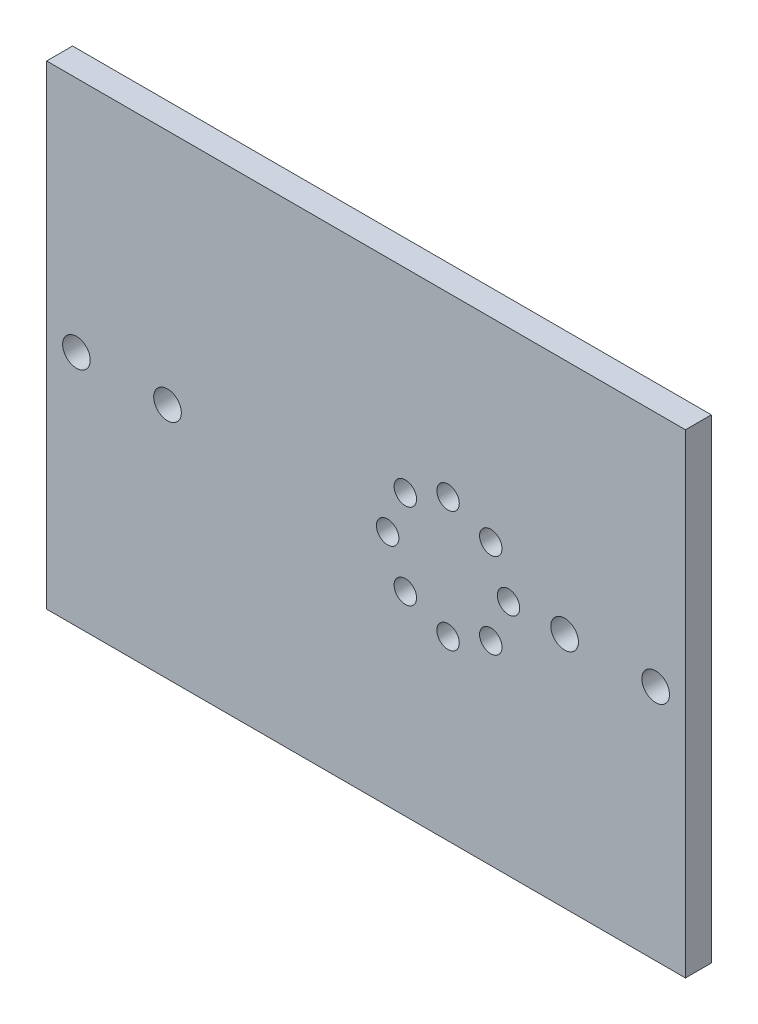
ISO-10303-21;
HEADER;
FILE_DESCRIPTION(('STEP AP214'),'2;1');
FILE_NAME('part.step','',(''),(''),'','','');
FILE_SCHEMA(('AUTOMOTIVE_DESIGN { 1 0 10303 214 1 1 1 1 }'));
ENDSEC;
DATA;
#1=APPLICATION_CONTEXT('core data for automotive mechanical design processes');
#2=APPLICATION_PROTOCOL_DEFINITION('international standard','automotive_design',2000,#1);
#3=PRODUCT_CONTEXT('',#1,'mechanical');
#4=PRODUCT('Part','Part','',(#3));
#5=PRODUCT_RELATED_PRODUCT_CATEGORY('part','',(#4));
#6=PRODUCT_DEFINITION_FORMATION('','',#4);
#7=PRODUCT_DEFINITION_CONTEXT('part definition',#1,'design');
#8=PRODUCT_DEFINITION('design','',#6,#7);
#9=PRODUCT_DEFINITION_SHAPE('','',#8);
#10=(LENGTH_UNIT() NAMED_UNIT(*) SI_UNIT(.MILLI.,.METRE.));
#11=(NAMED_UNIT(*) PLANE_ANGLE_UNIT() SI_UNIT($,.RADIAN.));
#12=(NAMED_UNIT(*) SI_UNIT($,.STERADIAN.) SOLID_ANGLE_UNIT());
#13=UNCERTAINTY_MEASURE_WITH_UNIT(LENGTH_MEASURE(1.E-05),#10,'distance_accuracy_value','');
#14=(GEOMETRIC_REPRESENTATION_CONTEXT(3) GLOBAL_UNCERTAINTY_ASSIGNED_CONTEXT((#13)) GLOBAL_UNIT_ASSIGNED_CONTEXT((#10,
#11,#12)) REPRESENTATION_CONTEXT('',''));
#15=CARTESIAN_POINT('',(0.,0.,0.));
#16=DIRECTION('',(0.,0.,1.));
#17=DIRECTION('',(1.,0.,0.));
#18=AXIS2_PLACEMENT_3D('',#15,#16,#17);
#19=CARTESIAN_POINT('',(37.,27.5,3.));
#20=DIRECTION('',(-1.,0.,0.));
#21=DIRECTION('',(0.,-1.,0.));
#22=AXIS2_PLACEMENT_3D('',#19,#20,#21);
#23=PLANE('',#22);
#24=DIRECTION('',(0.,1.,0.));
#25=VECTOR('',#24,1.);
#26=CARTESIAN_POINT('',(37.,27.5,0.));
#27=LINE('',#26,#25);
#28=CARTESIAN_POINT('',(37.,-27.5,0.));
#29=VERTEX_POINT('',#28);
#30=CARTESIAN_POINT('',(37.,27.5,0.));
#31=VERTEX_POINT('',#30);
#32=EDGE_CURVE('E107',#29,#31,#27,.T.);
#33=ORIENTED_EDGE('',*,*,#32,.T.);
#34=DIRECTION('',(0.,0.,-1.));
#35=VECTOR('',#34,1.);
#36=CARTESIAN_POINT('',(37.,27.5,3.));
#37=LINE('',#36,#35);
#38=CARTESIAN_POINT('',(37.,27.5,3.));
#39=VERTEX_POINT('',#38);
#40=EDGE_CURVE('E11',#39,#31,#37,.T.);
#41=ORIENTED_EDGE('',*,*,#40,.F.);
#42=DIRECTION('',(0.,1.,0.));
#43=VECTOR('',#42,1.);
#44=CARTESIAN_POINT('',(37.,27.5,3.));
#45=LINE('',#44,#43);
#46=CARTESIAN_POINT('',(37.,-27.5,3.));
#47=VERTEX_POINT('',#46);
#48=EDGE_CURVE('E91',#47,#39,#45,.T.);
#49=ORIENTED_EDGE('',*,*,#48,.F.);
#50=DIRECTION('',(0.,0.,-1.));
#51=VECTOR('',#50,1.);
#52=CARTESIAN_POINT('',(37.,-27.5,3.));
#53=LINE('',#52,#51);
#54=EDGE_CURVE('E103',#47,#29,#53,.T.);
#55=ORIENTED_EDGE('',*,*,#54,.T.);
#56=EDGE_LOOP('',(#33,#41,#49,#55));
#57=FACE_BOUND('',#56,.T.);
#58=ADVANCED_FACE('F39',(#57),#23,.F.);
#59=CARTESIAN_POINT('',(-37.,27.5,3.));
#60=DIRECTION('',(0.,-1.,0.));
#61=DIRECTION('',(0.,0.,-1.));
#62=AXIS2_PLACEMENT_3D('',#59,#60,#61);
#63=PLANE('',#62);
#64=DIRECTION('',(-1.,0.,0.));
#65=VECTOR('',#64,1.);
#66=CARTESIAN_POINT('',(-37.,27.5,0.));
#67=LINE('',#66,#65);
#68=CARTESIAN_POINT('',(-37.,27.5,0.));
#69=VERTEX_POINT('',#68);
#70=EDGE_CURVE('E96',#31,#69,#67,.T.);
#71=ORIENTED_EDGE('',*,*,#70,.T.);
#72=DIRECTION('',(0.,0.,-1.));
#73=VECTOR('',#72,1.);
#74=CARTESIAN_POINT('',(-37.,27.5,3.));
#75=LINE('',#74,#73);
#76=CARTESIAN_POINT('',(-37.,27.5,3.));
#77=VERTEX_POINT('',#76);
#78=EDGE_CURVE('E48',#77,#69,#75,.T.);
#79=ORIENTED_EDGE('',*,*,#78,.F.);
#80=DIRECTION('',(-1.,0.,0.));
#81=VECTOR('',#80,1.);
#82=CARTESIAN_POINT('',(-37.,27.5,3.));
#83=LINE('',#82,#81);
#84=EDGE_CURVE('E86',#39,#77,#83,.T.);
#85=ORIENTED_EDGE('',*,*,#84,.F.);
#86=ORIENTED_EDGE('',*,*,#40,.T.);
#87=EDGE_LOOP('',(#71,#79,#85,#86));
#88=FACE_BOUND('',#87,.T.);
#89=ADVANCED_FACE('F95',(#88),#63,.F.);
#90=CARTESIAN_POINT('',(-37.,27.5,3.));
#91=DIRECTION('',(1.,0.,0.));
#92=DIRECTION('',(0.,1.,0.));
#93=AXIS2_PLACEMENT_3D('',#90,#91,#92);
#94=PLANE('',#93);
#95=DIRECTION('',(0.,-1.,0.));
#96=VECTOR('',#95,1.);
#97=CARTESIAN_POINT('',(-37.,27.5,0.));
#98=LINE('',#97,#96);
#99=CARTESIAN_POINT('',(-37.,-27.5,0.));
#100=VERTEX_POINT('',#99);
#101=EDGE_CURVE('E73',#69,#100,#98,.T.);
#102=ORIENTED_EDGE('',*,*,#101,.T.);
#103=DIRECTION('',(0.,0.,-1.));
#104=VECTOR('',#103,1.);
#105=CARTESIAN_POINT('',(-37.,-27.5,3.));
#106=LINE('',#105,#104);
#107=CARTESIAN_POINT('',(-37.,-27.5,3.));
#108=VERTEX_POINT('',#107);
#109=EDGE_CURVE('E98',#108,#100,#106,.T.);
#110=ORIENTED_EDGE('',*,*,#109,.F.);
#111=DIRECTION('',(0.,-1.,0.));
#112=VECTOR('',#111,1.);
#113=CARTESIAN_POINT('',(-37.,27.5,3.));
#114=LINE('',#113,#112);
#115=EDGE_CURVE('E89',#77,#108,#114,.T.);
#116=ORIENTED_EDGE('',*,*,#115,.F.);
#117=ORIENTED_EDGE('',*,*,#78,.T.);
#118=EDGE_LOOP('',(#102,#110,#116,#117));
#119=FACE_BOUND('',#118,.T.);
#120=ADVANCED_FACE('F99',(#119),#94,.F.);
#121=CARTESIAN_POINT('',(-37.,-27.5,3.));
#122=DIRECTION('',(0.,1.,0.));
#123=DIRECTION('',(0.,0.,1.));
#124=AXIS2_PLACEMENT_3D('',#121,#122,#123);
#125=PLANE('',#124);
#126=DIRECTION('',(1.,0.,0.));
#127=VECTOR('',#126,1.);
#128=CARTESIAN_POINT('',(-37.,-27.5,0.));
#129=LINE('',#128,#127);
#130=EDGE_CURVE('E79',#100,#29,#129,.T.);
#131=ORIENTED_EDGE('',*,*,#130,.T.);
#132=ORIENTED_EDGE('',*,*,#54,.F.);
#133=DIRECTION('',(1.,0.,0.));
#134=VECTOR('',#133,1.);
#135=CARTESIAN_POINT('',(-37.,-27.5,3.));
#136=LINE('',#135,#134);
#137=EDGE_CURVE('E56',#108,#47,#136,.T.);
#138=ORIENTED_EDGE('',*,*,#137,.F.);
#139=ORIENTED_EDGE('',*,*,#109,.T.);
#140=EDGE_LOOP('',(#131,#132,#138,#139));
#141=FACE_BOUND('',#140,.T.);
#142=ADVANCED_FACE('F121',(#141),#125,.F.);
#143=CARTESIAN_POINT('',(0.,0.,3.));
#144=DIRECTION('',(0.,0.,1.));
#145=DIRECTION('',(1.,0.,0.));
#146=AXIS2_PLACEMENT_3D('',#143,#144,#145);
#147=PLANE('',#146);
#148=CARTESIAN_POINT('',(14.4497474683058,4.94974746830585,3.));
#149=DIRECTION('',(0.,0.,1.));
#150=DIRECTION('',(1.,0.,0.));
#151=AXIS2_PLACEMENT_3D('',#148,#149,#150);
#152=CIRCLE('',#151,1.3);
#153=CARTESIAN_POINT('',(15.7497474683058,4.94974746830585,3.));
#154=VERTEX_POINT('',#153);
#155=EDGE_CURVE('E168',#154,#154,#152,.T.);
#156=ORIENTED_EDGE('',*,*,#155,.F.);
#157=EDGE_LOOP('',(#156));
#158=FACE_BOUND('',#157,.T.);
#159=CARTESIAN_POINT('',(16.5,0.,3.));
#160=DIRECTION('',(0.,0.,1.));
#161=DIRECTION('',(1.,0.,0.));
#162=AXIS2_PLACEMENT_3D('',#159,#160,#161);
#163=CIRCLE('',#162,1.3);
#164=CARTESIAN_POINT('',(17.8,0.,3.));
#165=VERTEX_POINT('',#164);
#166=EDGE_CURVE('E176',#165,#165,#163,.T.);
#167=ORIENTED_EDGE('',*,*,#166,.F.);
#168=EDGE_LOOP('',(#167));
#169=FACE_BOUND('',#168,.T.);
#170=CARTESIAN_POINT('',(14.4497474683058,-4.94974746830582,3.));
#171=DIRECTION('',(0.,0.,1.));
#172=DIRECTION('',(1.,0.,0.));
#173=AXIS2_PLACEMENT_3D('',#170,#171,#172);
#174=CIRCLE('',#173,1.3);
#175=CARTESIAN_POINT('',(15.7497474683058,-4.94974746830582,3.));
#176=VERTEX_POINT('',#175);
#177=EDGE_CURVE('E184',#176,#176,#174,.T.);
#178=ORIENTED_EDGE('',*,*,#177,.F.);
#179=EDGE_LOOP('',(#178));
#180=FACE_BOUND('',#179,.T.);
#181=CARTESIAN_POINT('',(9.5,-6.99999999999999,3.));
#182=DIRECTION('',(0.,0.,1.));
#183=DIRECTION('',(1.,0.,0.));
#184=AXIS2_PLACEMENT_3D('',#181,#182,#183);
#185=CIRCLE('',#184,1.3);
#186=CARTESIAN_POINT('',(10.8,-6.99999999999999,3.));
#187=VERTEX_POINT('',#186);
#188=EDGE_CURVE('E192',#187,#187,#185,.T.);
#189=ORIENTED_EDGE('',*,*,#188,.F.);
#190=EDGE_LOOP('',(#189));
#191=FACE_BOUND('',#190,.T.);
#192=CARTESIAN_POINT('',(4.55025253169416,-4.94974746830582,3.));
#193=DIRECTION('',(0.,0.,1.));
#194=DIRECTION('',(1.,0.,0.));
#195=AXIS2_PLACEMENT_3D('',#192,#193,#194);
#196=CIRCLE('',#195,1.3);
#197=CARTESIAN_POINT('',(5.85025253169416,-4.94974746830582,3.));
#198=VERTEX_POINT('',#197);
#199=EDGE_CURVE('E200',#198,#198,#196,.T.);
#200=ORIENTED_EDGE('',*,*,#199,.F.);
#201=EDGE_LOOP('',(#200));
#202=FACE_BOUND('',#201,.T.);
#203=CARTESIAN_POINT('',(2.5,0.,3.));
#204=DIRECTION('',(0.,0.,1.));
#205=DIRECTION('',(1.,0.,0.));
#206=AXIS2_PLACEMENT_3D('',#203,#204,#205);
#207=CIRCLE('',#206,1.3);
#208=CARTESIAN_POINT('',(3.8,0.,3.));
#209=VERTEX_POINT('',#208);
#210=EDGE_CURVE('E208',#209,#209,#207,.T.);
#211=ORIENTED_EDGE('',*,*,#210,.F.);
#212=EDGE_LOOP('',(#211));
#213=FACE_BOUND('',#212,.T.);
#214=CARTESIAN_POINT('',(4.55025253169417,4.94974746830585,3.));
#215=DIRECTION('',(0.,0.,1.));
#216=DIRECTION('',(1.,0.,0.));
#217=AXIS2_PLACEMENT_3D('',#214,#215,#216);
#218=CIRCLE('',#217,1.3);
#219=CARTESIAN_POINT('',(5.85025253169417,4.94974746830585,3.));
#220=VERTEX_POINT('',#219);
#221=EDGE_CURVE('E216',#220,#220,#218,.T.);
#222=ORIENTED_EDGE('',*,*,#221,.F.);
#223=EDGE_LOOP('',(#222));
#224=FACE_BOUND('',#223,.T.);
#225=CARTESIAN_POINT('',(9.5,7.00000000000002,3.));
#226=DIRECTION('',(0.,0.,1.));
#227=DIRECTION('',(1.,0.,0.));
#228=AXIS2_PLACEMENT_3D('',#225,#226,#227);
#229=CIRCLE('',#228,1.3);
#230=CARTESIAN_POINT('',(10.8,7.00000000000002,3.));
#231=VERTEX_POINT('',#230);
#232=EDGE_CURVE('E160',#231,#231,#229,.T.);
#233=ORIENTED_EDGE('',*,*,#232,.F.);
#234=EDGE_LOOP('',(#233));
#235=FACE_BOUND('',#234,.T.);
#236=CARTESIAN_POINT('',(-33.55,0.,3.));
#237=DIRECTION('',(0.,0.,1.));
#238=DIRECTION('',(1.,0.,0.));
#239=AXIS2_PLACEMENT_3D('',#236,#237,#238);
#240=CIRCLE('',#239,1.60000000000001);
#241=CARTESIAN_POINT('',(-31.95,0.,3.));
#242=VERTEX_POINT('',#241);
#243=EDGE_CURVE('E153',#242,#242,#240,.T.);
#244=ORIENTED_EDGE('',*,*,#243,.F.);
#245=EDGE_LOOP('',(#244));
#246=FACE_BOUND('',#245,.T.);
#247=CARTESIAN_POINT('',(-23.,0.,3.));
#248=DIRECTION('',(0.,0.,1.));
#249=DIRECTION('',(1.,0.,0.));
#250=AXIS2_PLACEMENT_3D('',#247,#248,#249);
#251=CIRCLE('',#250,1.6);
#252=CARTESIAN_POINT('',(-21.4,0.,3.));
#253=VERTEX_POINT('',#252);
#254=EDGE_CURVE('E149',#253,#253,#251,.T.);
#255=ORIENTED_EDGE('',*,*,#254,.F.);
#256=EDGE_LOOP('',(#255));
#257=FACE_BOUND('',#256,.T.);
#258=CARTESIAN_POINT('',(23.,0.,3.));
#259=DIRECTION('',(0.,0.,1.));
#260=DIRECTION('',(1.,0.,0.));
#261=AXIS2_PLACEMENT_3D('',#258,#259,#260);
#262=CIRCLE('',#261,1.6);
#263=CARTESIAN_POINT('',(24.6,0.,3.));
#264=VERTEX_POINT('',#263);
#265=EDGE_CURVE('E141',#264,#264,#262,.T.);
#266=ORIENTED_EDGE('',*,*,#265,.F.);
#267=EDGE_LOOP('',(#266));
#268=FACE_BOUND('',#267,.T.);
#269=CARTESIAN_POINT('',(33.55,0.,3.));
#270=DIRECTION('',(0.,0.,1.));
#271=DIRECTION('',(1.,0.,0.));
#272=AXIS2_PLACEMENT_3D('',#269,#270,#271);
#273=CIRCLE('',#272,1.6);
#274=CARTESIAN_POINT('',(35.15,0.,3.));
#275=VERTEX_POINT('',#274);
#276=EDGE_CURVE('E132',#275,#275,#273,.T.);
#277=ORIENTED_EDGE('',*,*,#276,.F.);
#278=EDGE_LOOP('',(#277));
#279=FACE_BOUND('',#278,.T.);
#280=ORIENTED_EDGE('',*,*,#48,.T.);
#281=ORIENTED_EDGE('',*,*,#84,.T.);
#282=ORIENTED_EDGE('',*,*,#115,.T.);
#283=ORIENTED_EDGE('',*,*,#137,.T.);
#284=EDGE_LOOP('',(#280,#281,#282,#283));
#285=FACE_BOUND('',#284,.T.);
#286=ADVANCED_FACE('F87',(#158,#169,#180,#191,#202,#213,#224,#235,#246,#257,#268,#279,#285),
#147,.T.);
#287=CARTESIAN_POINT('',(0.,0.,0.));
#288=DIRECTION('',(0.,0.,1.));
#289=DIRECTION('',(1.,0.,0.));
#290=AXIS2_PLACEMENT_3D('',#287,#288,#289);
#291=PLANE('',#290);
#292=CARTESIAN_POINT('',(14.4497474683058,4.94974746830585,0.));
#293=DIRECTION('',(0.,0.,1.));
#294=DIRECTION('',(1.,0.,0.));
#295=AXIS2_PLACEMENT_3D('',#292,#293,#294);
#296=CIRCLE('',#295,1.3);
#297=CARTESIAN_POINT('',(15.7497474683058,4.94974746830585,0.));
#298=VERTEX_POINT('',#297);
#299=EDGE_CURVE('E172',#298,#298,#296,.T.);
#300=ORIENTED_EDGE('',*,*,#299,.T.);
#301=EDGE_LOOP('',(#300));
#302=FACE_BOUND('',#301,.T.);
#303=CARTESIAN_POINT('',(16.5,0.,0.));
#304=DIRECTION('',(0.,0.,1.));
#305=DIRECTION('',(1.,0.,0.));
#306=AXIS2_PLACEMENT_3D('',#303,#304,#305);
#307=CIRCLE('',#306,1.3);
#308=CARTESIAN_POINT('',(17.8,0.,0.));
#309=VERTEX_POINT('',#308);
#310=EDGE_CURVE('E180',#309,#309,#307,.T.);
#311=ORIENTED_EDGE('',*,*,#310,.T.);
#312=EDGE_LOOP('',(#311));
#313=FACE_BOUND('',#312,.T.);
#314=CARTESIAN_POINT('',(14.4497474683058,-4.94974746830582,0.));
#315=DIRECTION('',(0.,0.,1.));
#316=DIRECTION('',(1.,0.,0.));
#317=AXIS2_PLACEMENT_3D('',#314,#315,#316);
#318=CIRCLE('',#317,1.3);
#319=CARTESIAN_POINT('',(15.7497474683058,-4.94974746830582,0.));
#320=VERTEX_POINT('',#319);
#321=EDGE_CURVE('E188',#320,#320,#318,.T.);
#322=ORIENTED_EDGE('',*,*,#321,.T.);
#323=EDGE_LOOP('',(#322));
#324=FACE_BOUND('',#323,.T.);
#325=CARTESIAN_POINT('',(9.5,-6.99999999999999,0.));
#326=DIRECTION('',(0.,0.,1.));
#327=DIRECTION('',(1.,0.,0.));
#328=AXIS2_PLACEMENT_3D('',#325,#326,#327);
#329=CIRCLE('',#328,1.3);
#330=CARTESIAN_POINT('',(10.8,-6.99999999999999,0.));
#331=VERTEX_POINT('',#330);
#332=EDGE_CURVE('E196',#331,#331,#329,.T.);
#333=ORIENTED_EDGE('',*,*,#332,.T.);
#334=EDGE_LOOP('',(#333));
#335=FACE_BOUND('',#334,.T.);
#336=CARTESIAN_POINT('',(4.55025253169416,-4.94974746830582,0.));
#337=DIRECTION('',(0.,0.,1.));
#338=DIRECTION('',(1.,0.,0.));
#339=AXIS2_PLACEMENT_3D('',#336,#337,#338);
#340=CIRCLE('',#339,1.3);
#341=CARTESIAN_POINT('',(5.85025253169416,-4.94974746830582,0.));
#342=VERTEX_POINT('',#341);
#343=EDGE_CURVE('E204',#342,#342,#340,.T.);
#344=ORIENTED_EDGE('',*,*,#343,.T.);
#345=EDGE_LOOP('',(#344));
#346=FACE_BOUND('',#345,.T.);
#347=CARTESIAN_POINT('',(2.5,0.,0.));
#348=DIRECTION('',(0.,0.,1.));
#349=DIRECTION('',(1.,0.,0.));
#350=AXIS2_PLACEMENT_3D('',#347,#348,#349);
#351=CIRCLE('',#350,1.3);
#352=CARTESIAN_POINT('',(3.8,0.,0.));
#353=VERTEX_POINT('',#352);
#354=EDGE_CURVE('E212',#353,#353,#351,.T.);
#355=ORIENTED_EDGE('',*,*,#354,.T.);
#356=EDGE_LOOP('',(#355));
#357=FACE_BOUND('',#356,.T.);
#358=CARTESIAN_POINT('',(4.55025253169417,4.94974746830585,0.));
#359=DIRECTION('',(0.,0.,1.));
#360=DIRECTION('',(1.,0.,0.));
#361=AXIS2_PLACEMENT_3D('',#358,#359,#360);
#362=CIRCLE('',#361,1.3);
#363=CARTESIAN_POINT('',(5.85025253169417,4.94974746830585,0.));
#364=VERTEX_POINT('',#363);
#365=EDGE_CURVE('E164',#364,#364,#362,.T.);
#366=ORIENTED_EDGE('',*,*,#365,.T.);
#367=EDGE_LOOP('',(#366));
#368=FACE_BOUND('',#367,.T.);
#369=CARTESIAN_POINT('',(9.5,7.00000000000002,0.));
#370=DIRECTION('',(0.,0.,1.));
#371=DIRECTION('',(1.,0.,0.));
#372=AXIS2_PLACEMENT_3D('',#369,#370,#371);
#373=CIRCLE('',#372,1.3);
#374=CARTESIAN_POINT('',(10.8,7.00000000000002,0.));
#375=VERTEX_POINT('',#374);
#376=EDGE_CURVE('E133',#375,#375,#373,.T.);
#377=ORIENTED_EDGE('',*,*,#376,.T.);
#378=EDGE_LOOP('',(#377));
#379=FACE_BOUND('',#378,.T.);
#380=CARTESIAN_POINT('',(-33.55,0.,0.));
#381=DIRECTION('',(0.,0.,1.));
#382=DIRECTION('',(1.,0.,0.));
#383=AXIS2_PLACEMENT_3D('',#380,#381,#382);
#384=CIRCLE('',#383,1.60000000000001);
#385=CARTESIAN_POINT('',(-31.95,0.,0.));
#386=VERTEX_POINT('',#385);
#387=EDGE_CURVE('E111',#386,#386,#384,.T.);
#388=ORIENTED_EDGE('',*,*,#387,.T.);
#389=EDGE_LOOP('',(#388));
#390=FACE_BOUND('',#389,.T.);
#391=CARTESIAN_POINT('',(-23.,0.,0.));
#392=DIRECTION('',(0.,0.,1.));
#393=DIRECTION('',(1.,0.,0.));
#394=AXIS2_PLACEMENT_3D('',#391,#392,#393);
#395=CIRCLE('',#394,1.6);
#396=CARTESIAN_POINT('',(-21.4,0.,0.));
#397=VERTEX_POINT('',#396);
#398=EDGE_CURVE('E145',#397,#397,#395,.T.);
#399=ORIENTED_EDGE('',*,*,#398,.T.);
#400=EDGE_LOOP('',(#399));
#401=FACE_BOUND('',#400,.T.);
#402=CARTESIAN_POINT('',(23.,0.,0.));
#403=DIRECTION('',(0.,0.,1.));
#404=DIRECTION('',(1.,0.,0.));
#405=AXIS2_PLACEMENT_3D('',#402,#403,#404);
#406=CIRCLE('',#405,1.6);
#407=CARTESIAN_POINT('',(24.6,0.,0.));
#408=VERTEX_POINT('',#407);
#409=EDGE_CURVE('E137',#408,#408,#406,.T.);
#410=ORIENTED_EDGE('',*,*,#409,.T.);
#411=EDGE_LOOP('',(#410));
#412=FACE_BOUND('',#411,.T.);
#413=CARTESIAN_POINT('',(33.55,0.,0.));
#414=DIRECTION('',(0.,0.,1.));
#415=DIRECTION('',(1.,0.,0.));
#416=AXIS2_PLACEMENT_3D('',#413,#414,#415);
#417=CIRCLE('',#416,1.6);
#418=CARTESIAN_POINT('',(35.15,0.,0.));
#419=VERTEX_POINT('',#418);
#420=EDGE_CURVE('E128',#419,#419,#417,.T.);
#421=ORIENTED_EDGE('',*,*,#420,.T.);
#422=EDGE_LOOP('',(#421));
#423=FACE_BOUND('',#422,.T.);
#424=ORIENTED_EDGE('',*,*,#32,.F.);
#425=ORIENTED_EDGE('',*,*,#130,.F.);
#426=ORIENTED_EDGE('',*,*,#101,.F.);
#427=ORIENTED_EDGE('',*,*,#70,.F.);
#428=EDGE_LOOP('',(#424,#425,#426,#427));
#429=FACE_BOUND('',#428,.T.);
#430=ADVANCED_FACE('F124',(#302,#313,#324,#335,#346,#357,#368,#379,#390,#401,#412,#423,#429),
#291,.F.);
#431=CARTESIAN_POINT('',(33.55,0.,0.));
#432=DIRECTION('',(0.,0.,1.));
#433=DIRECTION('',(1.,0.,0.));
#434=AXIS2_PLACEMENT_3D('',#431,#432,#433);
#435=CYLINDRICAL_SURFACE('',#434,1.6);
#436=ORIENTED_EDGE('',*,*,#420,.F.);
#437=EDGE_LOOP('',(#436));
#438=FACE_BOUND('',#437,.T.);
#439=ORIENTED_EDGE('',*,*,#276,.T.);
#440=EDGE_LOOP('',(#439));
#441=FACE_BOUND('',#440,.T.);
#442=ADVANCED_FACE('F248',(#438,#441),#435,.F.);
#443=CARTESIAN_POINT('',(23.,0.,0.));
#444=DIRECTION('',(0.,0.,1.));
#445=DIRECTION('',(1.,0.,0.));
#446=AXIS2_PLACEMENT_3D('',#443,#444,#445);
#447=CYLINDRICAL_SURFACE('',#446,1.6);
#448=ORIENTED_EDGE('',*,*,#409,.F.);
#449=EDGE_LOOP('',(#448));
#450=FACE_BOUND('',#449,.T.);
#451=ORIENTED_EDGE('',*,*,#265,.T.);
#452=EDGE_LOOP('',(#451));
#453=FACE_BOUND('',#452,.T.);
#454=ADVANCED_FACE('F250',(#450,#453),#447,.F.);
#455=CARTESIAN_POINT('',(-23.,0.,0.));
#456=DIRECTION('',(0.,0.,1.));
#457=DIRECTION('',(1.,0.,0.));
#458=AXIS2_PLACEMENT_3D('',#455,#456,#457);
#459=CYLINDRICAL_SURFACE('',#458,1.6);
#460=ORIENTED_EDGE('',*,*,#398,.F.);
#461=EDGE_LOOP('',(#460));
#462=FACE_BOUND('',#461,.T.);
#463=ORIENTED_EDGE('',*,*,#254,.T.);
#464=EDGE_LOOP('',(#463));
#465=FACE_BOUND('',#464,.T.);
#466=ADVANCED_FACE('F257',(#462,#465),#459,.F.);
#467=CARTESIAN_POINT('',(-33.55,0.,0.));
#468=DIRECTION('',(0.,0.,1.));
#469=DIRECTION('',(1.,0.,0.));
#470=AXIS2_PLACEMENT_3D('',#467,#468,#469);
#471=CYLINDRICAL_SURFACE('',#470,1.60000000000001);
#472=ORIENTED_EDGE('',*,*,#387,.F.);
#473=EDGE_LOOP('',(#472));
#474=FACE_BOUND('',#473,.T.);
#475=ORIENTED_EDGE('',*,*,#243,.T.);
#476=EDGE_LOOP('',(#475));
#477=FACE_BOUND('',#476,.T.);
#478=ADVANCED_FACE('F296',(#474,#477),#471,.F.);
#479=CARTESIAN_POINT('',(9.5,7.00000000000002,0.));
#480=DIRECTION('',(0.,0.,1.));
#481=DIRECTION('',(1.,0.,0.));
#482=AXIS2_PLACEMENT_3D('',#479,#480,#481);
#483=CYLINDRICAL_SURFACE('',#482,1.3);
#484=ORIENTED_EDGE('',*,*,#376,.F.);
#485=EDGE_LOOP('',(#484));
#486=FACE_BOUND('',#485,.T.);
#487=ORIENTED_EDGE('',*,*,#232,.T.);
#488=EDGE_LOOP('',(#487));
#489=FACE_BOUND('',#488,.T.);
#490=ADVANCED_FACE('F230',(#486,#489),#483,.F.);
#491=CARTESIAN_POINT('',(4.55025253169417,4.94974746830585,0.));
#492=DIRECTION('',(0.,0.,1.));
#493=DIRECTION('',(1.,0.,0.));
#494=AXIS2_PLACEMENT_3D('',#491,#492,#493);
#495=CYLINDRICAL_SURFACE('',#494,1.3);
#496=ORIENTED_EDGE('',*,*,#365,.F.);
#497=EDGE_LOOP('',(#496));
#498=FACE_BOUND('',#497,.T.);
#499=ORIENTED_EDGE('',*,*,#221,.T.);
#500=EDGE_LOOP('',(#499));
#501=FACE_BOUND('',#500,.T.);
#502=ADVANCED_FACE('F226',(#498,#501),#495,.F.);
#503=CARTESIAN_POINT('',(2.5,0.,0.));
#504=DIRECTION('',(0.,0.,1.));
#505=DIRECTION('',(1.,0.,0.));
#506=AXIS2_PLACEMENT_3D('',#503,#504,#505);
#507=CYLINDRICAL_SURFACE('',#506,1.3);
#508=ORIENTED_EDGE('',*,*,#354,.F.);
#509=EDGE_LOOP('',(#508));
#510=FACE_BOUND('',#509,.T.);
#511=ORIENTED_EDGE('',*,*,#210,.T.);
#512=EDGE_LOOP('',(#511));
#513=FACE_BOUND('',#512,.T.);
#514=ADVANCED_FACE('F229',(#510,#513),#507,.F.);
#515=CARTESIAN_POINT('',(4.55025253169416,-4.94974746830582,0.));
#516=DIRECTION('',(0.,0.,1.));
#517=DIRECTION('',(1.,0.,0.));
#518=AXIS2_PLACEMENT_3D('',#515,#516,#517);
#519=CYLINDRICAL_SURFACE('',#518,1.3);
#520=ORIENTED_EDGE('',*,*,#343,.F.);
#521=EDGE_LOOP('',(#520));
#522=FACE_BOUND('',#521,.T.);
#523=ORIENTED_EDGE('',*,*,#199,.T.);
#524=EDGE_LOOP('',(#523));
#525=FACE_BOUND('',#524,.T.);
#526=ADVANCED_FACE('F314',(#522,#525),#519,.F.);
#527=CARTESIAN_POINT('',(9.5,-6.99999999999999,0.));
#528=DIRECTION('',(0.,0.,1.));
#529=DIRECTION('',(1.,0.,0.));
#530=AXIS2_PLACEMENT_3D('',#527,#528,#529);
#531=CYLINDRICAL_SURFACE('',#530,1.3);
#532=ORIENTED_EDGE('',*,*,#332,.F.);
#533=EDGE_LOOP('',(#532));
#534=FACE_BOUND('',#533,.T.);
#535=ORIENTED_EDGE('',*,*,#188,.T.);
#536=EDGE_LOOP('',(#535));
#537=FACE_BOUND('',#536,.T.);
#538=ADVANCED_FACE('F324',(#534,#537),#531,.F.);
#539=CARTESIAN_POINT('',(14.4497474683058,-4.94974746830582,0.));
#540=DIRECTION('',(0.,0.,1.));
#541=DIRECTION('',(1.,0.,0.));
#542=AXIS2_PLACEMENT_3D('',#539,#540,#541);
#543=CYLINDRICAL_SURFACE('',#542,1.3);
#544=ORIENTED_EDGE('',*,*,#321,.F.);
#545=EDGE_LOOP('',(#544));
#546=FACE_BOUND('',#545,.T.);
#547=ORIENTED_EDGE('',*,*,#177,.T.);
#548=EDGE_LOOP('',(#547));
#549=FACE_BOUND('',#548,.T.);
#550=ADVANCED_FACE('F334',(#546,#549),#543,.F.);
#551=CARTESIAN_POINT('',(16.5,0.,0.));
#552=DIRECTION('',(0.,0.,1.));
#553=DIRECTION('',(1.,0.,0.));
#554=AXIS2_PLACEMENT_3D('',#551,#552,#553);
#555=CYLINDRICAL_SURFACE('',#554,1.3);
#556=ORIENTED_EDGE('',*,*,#310,.F.);
#557=EDGE_LOOP('',(#556));
#558=FACE_BOUND('',#557,.T.);
#559=ORIENTED_EDGE('',*,*,#166,.T.);
#560=EDGE_LOOP('',(#559));
#561=FACE_BOUND('',#560,.T.);
#562=ADVANCED_FACE('F344',(#558,#561),#555,.F.);
#563=CARTESIAN_POINT('',(14.4497474683058,4.94974746830585,0.));
#564=DIRECTION('',(0.,0.,1.));
#565=DIRECTION('',(1.,0.,0.));
#566=AXIS2_PLACEMENT_3D('',#563,#564,#565);
#567=CYLINDRICAL_SURFACE('',#566,1.3);
#568=ORIENTED_EDGE('',*,*,#299,.F.);
#569=EDGE_LOOP('',(#568));
#570=FACE_BOUND('',#569,.T.);
#571=ORIENTED_EDGE('',*,*,#155,.T.);
#572=EDGE_LOOP('',(#571));
#573=FACE_BOUND('',#572,.T.);
#574=ADVANCED_FACE('F354',(#570,#573),#567,.F.);
#575=CLOSED_SHELL('',(#58,#89,#120,#142,#286,#430,#442,#454,#466,#478,#490,#502,#514,#526,#538,
#550,#562,#574));
#576=MANIFOLD_SOLID_BREP('B2',#575);
#577=ADVANCED_BREP_SHAPE_REPRESENTATION('',(#18,#576),#14);
#578=SHAPE_DEFINITION_REPRESENTATION(#9,#577);
ENDSEC;
END-ISO-10303-21;
